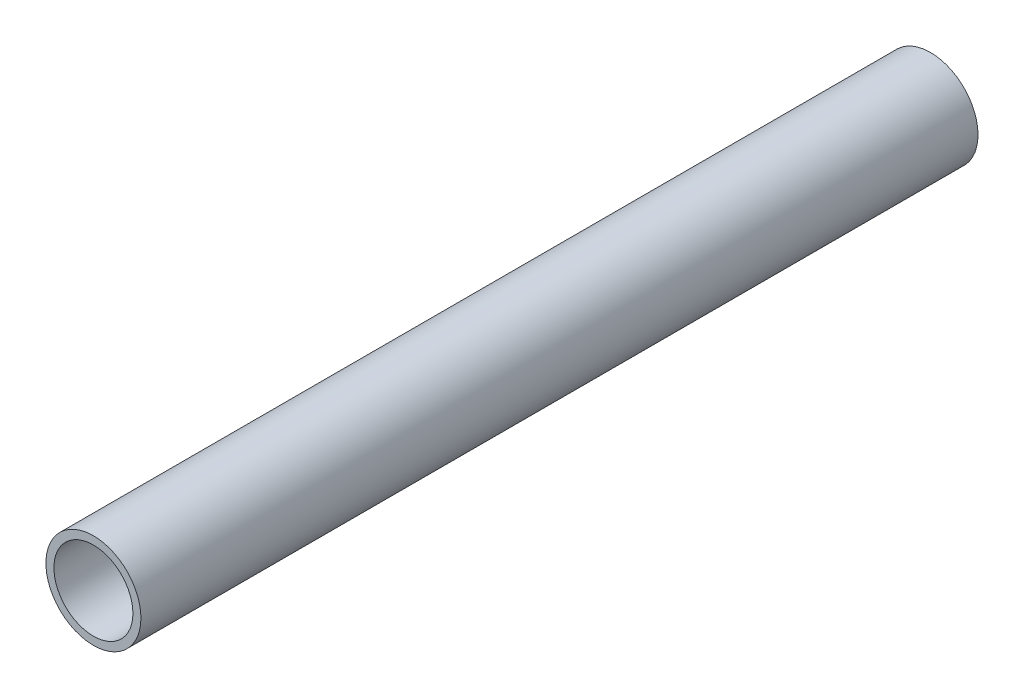
ISO-10303-21;
HEADER;
FILE_DESCRIPTION(('STEP AP214'),'2;1');
FILE_NAME('part.step','',(''),(''),'','','');
FILE_SCHEMA(('AUTOMOTIVE_DESIGN { 1 0 10303 214 1 1 1 1 }'));
ENDSEC;
DATA;
#1=APPLICATION_CONTEXT('core data for automotive mechanical design processes');
#2=APPLICATION_PROTOCOL_DEFINITION('international standard','automotive_design',2000,#1);
#3=PRODUCT_CONTEXT('',#1,'mechanical');
#4=PRODUCT('Part','Part','',(#3));
#5=PRODUCT_RELATED_PRODUCT_CATEGORY('part','',(#4));
#6=PRODUCT_DEFINITION_FORMATION('','',#4);
#7=PRODUCT_DEFINITION_CONTEXT('part definition',#1,'design');
#8=PRODUCT_DEFINITION('design','',#6,#7);
#9=PRODUCT_DEFINITION_SHAPE('','',#8);
#10=(LENGTH_UNIT() NAMED_UNIT(*) SI_UNIT(.MILLI.,.METRE.));
#11=(NAMED_UNIT(*) PLANE_ANGLE_UNIT() SI_UNIT($,.RADIAN.));
#12=(NAMED_UNIT(*) SI_UNIT($,.STERADIAN.) SOLID_ANGLE_UNIT());
#13=UNCERTAINTY_MEASURE_WITH_UNIT(LENGTH_MEASURE(1.E-05),#10,'distance_accuracy_value','');
#14=(GEOMETRIC_REPRESENTATION_CONTEXT(3) GLOBAL_UNCERTAINTY_ASSIGNED_CONTEXT((#13)) GLOBAL_UNIT_ASSIGNED_CONTEXT((#10,
#11,#12)) REPRESENTATION_CONTEXT('',''));
#15=CARTESIAN_POINT('',(0.,0.,0.));
#16=DIRECTION('',(0.,0.,1.));
#17=DIRECTION('',(1.,0.,0.));
#18=AXIS2_PLACEMENT_3D('',#15,#16,#17);
#19=CARTESIAN_POINT('',(-568.325,22.225,371.475));
#20=DIRECTION('',(0.,0.,1.));
#21=DIRECTION('',(1.,0.,0.));
#22=AXIS2_PLACEMENT_3D('',#19,#20,#21);
#23=CYLINDRICAL_SURFACE('',#22,17.526);
#24=CARTESIAN_POINT('',(-568.325,22.225,0.));
#25=DIRECTION('',(0.,0.,1.));
#26=DIRECTION('',(1.,0.,0.));
#27=AXIS2_PLACEMENT_3D('',#24,#25,#26);
#28=CIRCLE('',#27,17.526);
#29=CARTESIAN_POINT('',(-550.799,22.225,0.));
#30=VERTEX_POINT('',#29);
#31=EDGE_CURVE('E24',#30,#30,#28,.T.);
#32=ORIENTED_EDGE('',*,*,#31,.F.);
#33=EDGE_LOOP('',(#32));
#34=FACE_BOUND('',#33,.T.);
#35=CARTESIAN_POINT('',(-568.325,22.225,371.475));
#36=DIRECTION('',(0.,0.,1.));
#37=DIRECTION('',(1.,0.,0.));
#38=AXIS2_PLACEMENT_3D('',#35,#36,#37);
#39=CIRCLE('',#38,17.526);
#40=CARTESIAN_POINT('',(-550.799,22.225,371.475));
#41=VERTEX_POINT('',#40);
#42=EDGE_CURVE('E15',#41,#41,#39,.T.);
#43=ORIENTED_EDGE('',*,*,#42,.T.);
#44=EDGE_LOOP('',(#43));
#45=FACE_BOUND('',#44,.T.);
#46=ADVANCED_FACE('F12',(#34,#45),#23,.F.);
#47=CARTESIAN_POINT('',(-35.941,38.1,371.475));
#48=DIRECTION('',(0.,0.,-1.));
#49=DIRECTION('',(-1.,0.,0.));
#50=AXIS2_PLACEMENT_3D('',#47,#48,#49);
#51=PLANE('',#50);
#52=CARTESIAN_POINT('',(-568.325,22.225,371.475));
#53=DIRECTION('',(0.,0.,1.));
#54=DIRECTION('',(1.,0.,0.));
#55=AXIS2_PLACEMENT_3D('',#52,#53,#54);
#56=CIRCLE('',#55,21.082);
#57=CARTESIAN_POINT('',(-547.243,22.225,371.475));
#58=VERTEX_POINT('',#57);
#59=EDGE_CURVE('E19',#58,#58,#56,.F.);
#60=ORIENTED_EDGE('',*,*,#59,.F.);
#61=EDGE_LOOP('',(#60));
#62=FACE_BOUND('',#61,.T.);
#63=ORIENTED_EDGE('',*,*,#42,.F.);
#64=EDGE_LOOP('',(#63));
#65=FACE_BOUND('',#64,.T.);
#66=ADVANCED_FACE('F33',(#62,#65),#51,.F.);
#67=CARTESIAN_POINT('',(-35.941,38.1,0.));
#68=DIRECTION('',(0.,0.,-1.));
#69=DIRECTION('',(-1.,0.,0.));
#70=AXIS2_PLACEMENT_3D('',#67,#68,#69);
#71=PLANE('',#70);
#72=CARTESIAN_POINT('',(-568.325,22.225,0.));
#73=DIRECTION('',(0.,0.,1.));
#74=DIRECTION('',(1.,0.,0.));
#75=AXIS2_PLACEMENT_3D('',#72,#73,#74);
#76=CIRCLE('',#75,21.082);
#77=CARTESIAN_POINT('',(-547.243,22.225,0.));
#78=VERTEX_POINT('',#77);
#79=EDGE_CURVE('E8',#78,#78,#76,.T.);
#80=ORIENTED_EDGE('',*,*,#79,.F.);
#81=EDGE_LOOP('',(#80));
#82=FACE_BOUND('',#81,.T.);
#83=ORIENTED_EDGE('',*,*,#31,.T.);
#84=EDGE_LOOP('',(#83));
#85=FACE_BOUND('',#84,.T.);
#86=ADVANCED_FACE('F35',(#82,#85),#71,.T.);
#87=CARTESIAN_POINT('',(-568.325,22.225,371.475));
#88=DIRECTION('',(0.,0.,1.));
#89=DIRECTION('',(1.,0.,0.));
#90=AXIS2_PLACEMENT_3D('',#87,#88,#89);
#91=CYLINDRICAL_SURFACE('',#90,21.082);
#92=ORIENTED_EDGE('',*,*,#79,.T.);
#93=EDGE_LOOP('',(#92));
#94=FACE_BOUND('',#93,.T.);
#95=ORIENTED_EDGE('',*,*,#59,.T.);
#96=EDGE_LOOP('',(#95));
#97=FACE_BOUND('',#96,.T.);
#98=ADVANCED_FACE('F42',(#94,#97),#91,.T.);
#99=CLOSED_SHELL('',(#46,#66,#86,#98));
#100=MANIFOLD_SOLID_BREP('B1',#99);
#101=ADVANCED_BREP_SHAPE_REPRESENTATION('',(#18,#100),#14);
#102=SHAPE_DEFINITION_REPRESENTATION(#9,#101);
ENDSEC;
END-ISO-10303-21;
